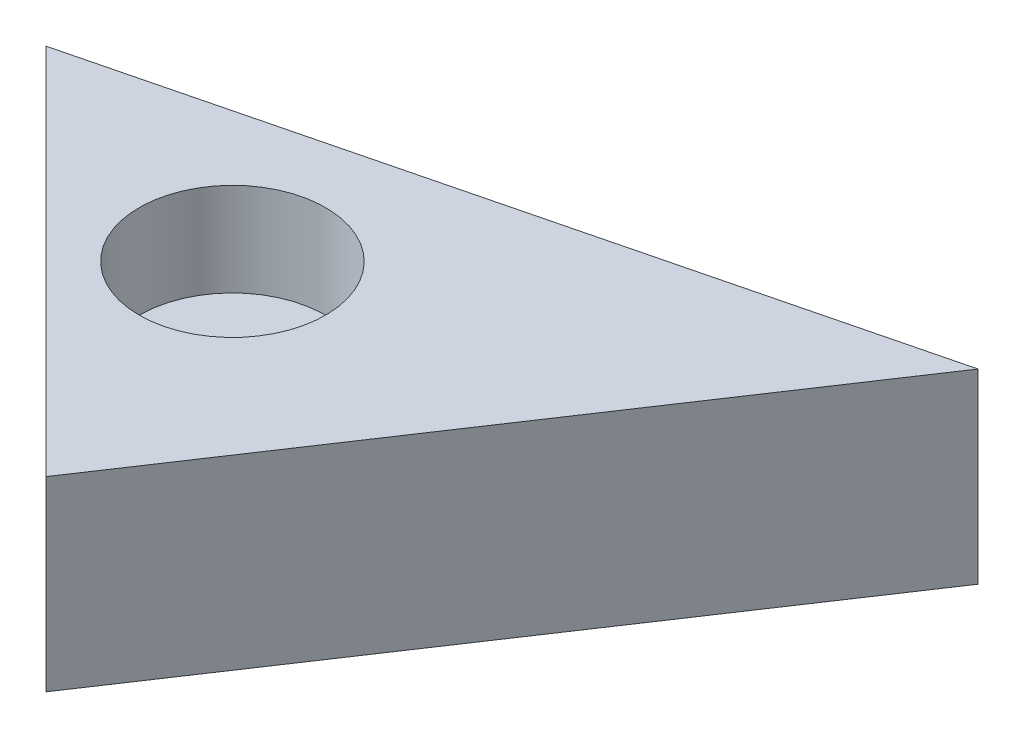
ISO-10303-21;
HEADER;
FILE_DESCRIPTION(('STEP AP214'),'2;1');
FILE_NAME('part.step','',(''),(''),'','','');
FILE_SCHEMA(('AUTOMOTIVE_DESIGN { 1 0 10303 214 1 1 1 1 }'));
ENDSEC;
DATA;
#1=APPLICATION_CONTEXT('core data for automotive mechanical design processes');
#2=APPLICATION_PROTOCOL_DEFINITION('international standard','automotive_design',2000,#1);
#3=PRODUCT_CONTEXT('',#1,'mechanical');
#4=PRODUCT('Part','Part','',(#3));
#5=PRODUCT_RELATED_PRODUCT_CATEGORY('part','',(#4));
#6=PRODUCT_DEFINITION_FORMATION('','',#4);
#7=PRODUCT_DEFINITION_CONTEXT('part definition',#1,'design');
#8=PRODUCT_DEFINITION('design','',#6,#7);
#9=PRODUCT_DEFINITION_SHAPE('','',#8);
#10=(LENGTH_UNIT() NAMED_UNIT(*) SI_UNIT(.MILLI.,.METRE.));
#11=(NAMED_UNIT(*) PLANE_ANGLE_UNIT() SI_UNIT($,.RADIAN.));
#12=(NAMED_UNIT(*) SI_UNIT($,.STERADIAN.) SOLID_ANGLE_UNIT());
#13=UNCERTAINTY_MEASURE_WITH_UNIT(LENGTH_MEASURE(1.E-05),#10,'distance_accuracy_value','');
#14=(GEOMETRIC_REPRESENTATION_CONTEXT(3) GLOBAL_UNCERTAINTY_ASSIGNED_CONTEXT((#13)) GLOBAL_UNIT_ASSIGNED_CONTEXT((#10,
#11,#12)) REPRESENTATION_CONTEXT('',''));
#15=CARTESIAN_POINT('',(0.,0.,0.));
#16=DIRECTION('',(0.,0.,1.));
#17=DIRECTION('',(1.,0.,0.));
#18=AXIS2_PLACEMENT_3D('',#15,#16,#17);
#19=CARTESIAN_POINT('',(101.6,25.4,-25.4));
#20=DIRECTION('',(0.242535625036333,0.,0.970142500145332));
#21=DIRECTION('',(0.970142500145332,0.,-0.242535625036333));
#22=AXIS2_PLACEMENT_3D('',#19,#20,#21);
#23=PLANE('',#22);
#24=DIRECTION('',(-0.970142500145332,0.,0.242535625036333));
#25=VECTOR('',#24,1.);
#26=CARTESIAN_POINT('',(101.6,0.,-25.4));
#27=LINE('',#26,#25);
#28=CARTESIAN_POINT('',(101.6,0.,-25.4));
#29=VERTEX_POINT('',#28);
#30=CARTESIAN_POINT('',(0.,0.,0.));
#31=VERTEX_POINT('',#30);
#32=EDGE_CURVE('E83',#29,#31,#27,.T.);
#33=ORIENTED_EDGE('',*,*,#32,.T.);
#34=DIRECTION('',(0.,-1.,0.));
#35=VECTOR('',#34,1.);
#36=CARTESIAN_POINT('',(0.,25.4,0.));
#37=LINE('',#36,#35);
#38=CARTESIAN_POINT('',(0.,25.4,0.));
#39=VERTEX_POINT('',#38);
#40=EDGE_CURVE('E11',#39,#31,#37,.T.);
#41=ORIENTED_EDGE('',*,*,#40,.F.);
#42=DIRECTION('',(-0.970142500145332,0.,0.242535625036333));
#43=VECTOR('',#42,1.);
#44=CARTESIAN_POINT('',(101.6,25.4,-25.4));
#45=LINE('',#44,#43);
#46=CARTESIAN_POINT('',(101.6,25.4,-25.4));
#47=VERTEX_POINT('',#46);
#48=EDGE_CURVE('E76',#47,#39,#45,.T.);
#49=ORIENTED_EDGE('',*,*,#48,.F.);
#50=DIRECTION('',(0.,-1.,0.));
#51=VECTOR('',#50,1.);
#52=CARTESIAN_POINT('',(101.6,25.4,-25.4));
#53=LINE('',#52,#51);
#54=EDGE_CURVE('E84',#47,#29,#53,.T.);
#55=ORIENTED_EDGE('',*,*,#54,.T.);
#56=EDGE_LOOP('',(#33,#41,#49,#55));
#57=FACE_BOUND('',#56,.T.);
#58=ADVANCED_FACE('F36',(#57),#23,.F.);
#59=CARTESIAN_POINT('',(0.,25.4,0.));
#60=DIRECTION('',(0.707106781186548,0.,-0.707106781186548));
#61=DIRECTION('',(-0.707106781186548,0.,-0.707106781186548));
#62=AXIS2_PLACEMENT_3D('',#59,#60,#61);
#63=PLANE('',#62);
#64=DIRECTION('',(0.707106781186547,0.,0.707106781186547));
#65=VECTOR('',#64,1.);
#66=CARTESIAN_POINT('',(0.,0.,0.));
#67=LINE('',#66,#65);
#68=CARTESIAN_POINT('',(50.8,0.,50.8));
#69=VERTEX_POINT('',#68);
#70=EDGE_CURVE('E64',#31,#69,#67,.T.);
#71=ORIENTED_EDGE('',*,*,#70,.T.);
#72=DIRECTION('',(0.,-1.,0.));
#73=VECTOR('',#72,1.);
#74=CARTESIAN_POINT('',(50.8,25.4,50.8));
#75=LINE('',#74,#73);
#76=CARTESIAN_POINT('',(50.8,25.4,50.8));
#77=VERTEX_POINT('',#76);
#78=EDGE_CURVE('E44',#77,#69,#75,.T.);
#79=ORIENTED_EDGE('',*,*,#78,.F.);
#80=DIRECTION('',(0.707106781186547,0.,0.707106781186547));
#81=VECTOR('',#80,1.);
#82=CARTESIAN_POINT('',(0.,25.4,0.));
#83=LINE('',#82,#81);
#84=EDGE_CURVE('E72',#39,#77,#83,.T.);
#85=ORIENTED_EDGE('',*,*,#84,.F.);
#86=ORIENTED_EDGE('',*,*,#40,.T.);
#87=EDGE_LOOP('',(#71,#79,#85,#86));
#88=FACE_BOUND('',#87,.T.);
#89=ADVANCED_FACE('F73',(#88),#63,.F.);
#90=CARTESIAN_POINT('',(50.8,25.4,50.8));
#91=DIRECTION('',(-0.832050294337844,0.,-0.554700196225229));
#92=DIRECTION('',(-0.554700196225229,0.,0.832050294337844));
#93=AXIS2_PLACEMENT_3D('',#90,#91,#92);
#94=PLANE('',#93);
#95=DIRECTION('',(0.554700196225229,0.,-0.832050294337844));
#96=VECTOR('',#95,1.);
#97=CARTESIAN_POINT('',(50.8,0.,50.8));
#98=LINE('',#97,#96);
#99=EDGE_CURVE('E69',#69,#29,#98,.T.);
#100=ORIENTED_EDGE('',*,*,#99,.T.);
#101=ORIENTED_EDGE('',*,*,#54,.F.);
#102=DIRECTION('',(0.554700196225229,0.,-0.832050294337844));
#103=VECTOR('',#102,1.);
#104=CARTESIAN_POINT('',(50.8,25.4,50.8));
#105=LINE('',#104,#103);
#106=EDGE_CURVE('E52',#77,#47,#105,.T.);
#107=ORIENTED_EDGE('',*,*,#106,.F.);
#108=ORIENTED_EDGE('',*,*,#78,.T.);
#109=EDGE_LOOP('',(#100,#101,#107,#108));
#110=FACE_BOUND('',#109,.T.);
#111=ADVANCED_FACE('F95',(#110),#94,.F.);
#112=CARTESIAN_POINT('',(0.,25.4,0.));
#113=DIRECTION('',(0.,1.,0.));
#114=DIRECTION('',(0.,0.,1.));
#115=AXIS2_PLACEMENT_3D('',#112,#113,#114);
#116=PLANE('',#115);
#117=CARTESIAN_POINT('',(38.1,25.4,12.7));
#118=DIRECTION('',(0.,1.,0.));
#119=DIRECTION('',(0.,0.,1.));
#120=AXIS2_PLACEMENT_3D('',#117,#118,#119);
#121=CIRCLE('',#120,12.7);
#122=CARTESIAN_POINT('',(38.1,25.4,25.4));
#123=VERTEX_POINT('',#122);
#124=EDGE_CURVE('E90',#123,#123,#121,.T.);
#125=ORIENTED_EDGE('',*,*,#124,.F.);
#126=EDGE_LOOP('',(#125));
#127=FACE_BOUND('',#126,.T.);
#128=ORIENTED_EDGE('',*,*,#48,.T.);
#129=ORIENTED_EDGE('',*,*,#84,.T.);
#130=ORIENTED_EDGE('',*,*,#106,.T.);
#131=EDGE_LOOP('',(#128,#129,#130));
#132=FACE_BOUND('',#131,.T.);
#133=ADVANCED_FACE('F79',(#127,#132),#116,.T.);
#134=CARTESIAN_POINT('',(0.,0.,0.));
#135=DIRECTION('',(0.,1.,0.));
#136=DIRECTION('',(0.,0.,1.));
#137=AXIS2_PLACEMENT_3D('',#134,#135,#136);
#138=PLANE('',#137);
#139=ORIENTED_EDGE('',*,*,#32,.F.);
#140=ORIENTED_EDGE('',*,*,#99,.F.);
#141=ORIENTED_EDGE('',*,*,#70,.F.);
#142=EDGE_LOOP('',(#139,#140,#141));
#143=FACE_BOUND('',#142,.T.);
#144=ADVANCED_FACE('F96',(#143),#138,.F.);
#145=CARTESIAN_POINT('',(38.1,12.7,12.7));
#146=DIRECTION('',(0.,1.,0.));
#147=DIRECTION('',(0.,0.,1.));
#148=AXIS2_PLACEMENT_3D('',#145,#146,#147);
#149=CYLINDRICAL_SURFACE('',#148,12.7);
#150=CARTESIAN_POINT('',(38.1,12.7,12.7));
#151=DIRECTION('',(0.,1.,0.));
#152=DIRECTION('',(0.,0.,1.));
#153=AXIS2_PLACEMENT_3D('',#150,#151,#152);
#154=CIRCLE('',#153,12.7);
#155=CARTESIAN_POINT('',(38.1,12.7,25.4));
#156=VERTEX_POINT('',#155);
#157=EDGE_CURVE('E86',#156,#156,#154,.T.);
#158=ORIENTED_EDGE('',*,*,#157,.F.);
#159=EDGE_LOOP('',(#158));
#160=FACE_BOUND('',#159,.T.);
#161=ORIENTED_EDGE('',*,*,#124,.T.);
#162=EDGE_LOOP('',(#161));
#163=FACE_BOUND('',#162,.T.);
#164=ADVANCED_FACE('F98',(#160,#163),#149,.F.);
#165=CARTESIAN_POINT('',(38.1,12.7,12.7));
#166=DIRECTION('',(0.,1.,0.));
#167=DIRECTION('',(0.,0.,1.));
#168=AXIS2_PLACEMENT_3D('',#165,#166,#167);
#169=PLANE('',#168);
#170=ORIENTED_EDGE('',*,*,#157,.T.);
#171=EDGE_LOOP('',(#170));
#172=FACE_BOUND('',#171,.T.);
#173=ADVANCED_FACE('F104',(#172),#169,.T.);
#174=CLOSED_SHELL('',(#58,#89,#111,#133,#144,#164,#173));
#175=MANIFOLD_SOLID_BREP('B2',#174);
#176=ADVANCED_BREP_SHAPE_REPRESENTATION('',(#18,#175),#14);
#177=SHAPE_DEFINITION_REPRESENTATION(#9,#176);
ENDSEC;
END-ISO-10303-21;
